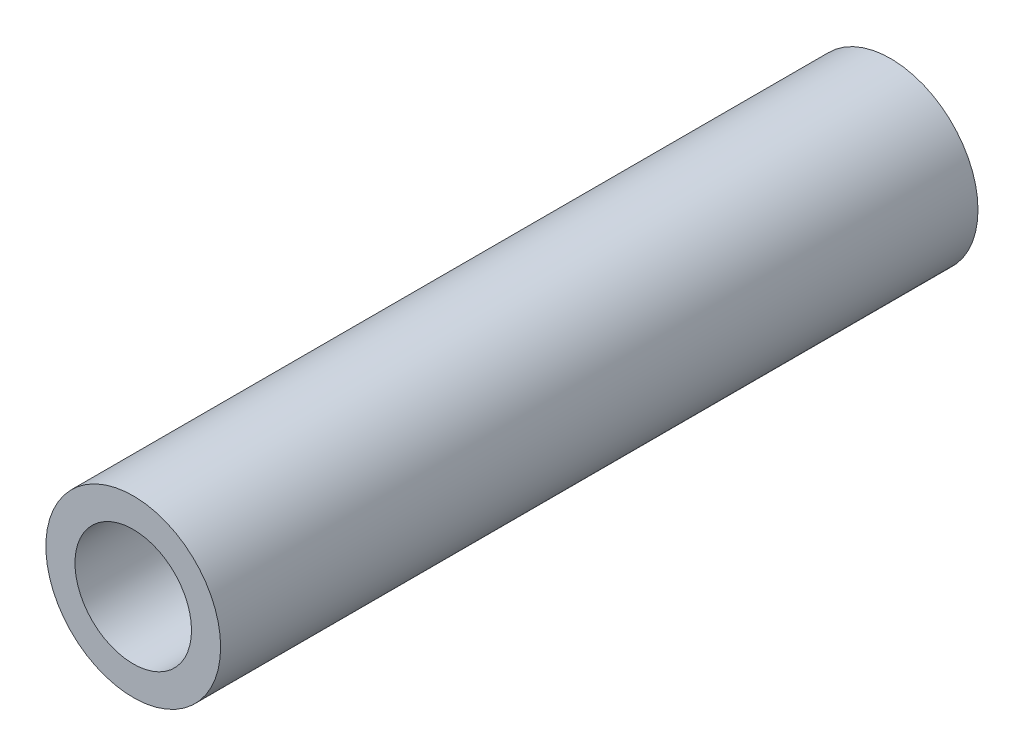
ISO-10303-21;
HEADER;
FILE_DESCRIPTION(('STEP AP214'),'2;1');
FILE_NAME('part.step','',(''),(''),'','','');
FILE_SCHEMA(('AUTOMOTIVE_DESIGN { 1 0 10303 214 1 1 1 1 }'));
ENDSEC;
DATA;
#1=APPLICATION_CONTEXT('core data for automotive mechanical design processes');
#2=APPLICATION_PROTOCOL_DEFINITION('international standard','automotive_design',2000,#1);
#3=PRODUCT_CONTEXT('',#1,'mechanical');
#4=PRODUCT('Part','Part','',(#3));
#5=PRODUCT_RELATED_PRODUCT_CATEGORY('part','',(#4));
#6=PRODUCT_DEFINITION_FORMATION('','',#4);
#7=PRODUCT_DEFINITION_CONTEXT('part definition',#1,'design');
#8=PRODUCT_DEFINITION('design','',#6,#7);
#9=PRODUCT_DEFINITION_SHAPE('','',#8);
#10=(LENGTH_UNIT() NAMED_UNIT(*) SI_UNIT(.MILLI.,.METRE.));
#11=(NAMED_UNIT(*) PLANE_ANGLE_UNIT() SI_UNIT($,.RADIAN.));
#12=(NAMED_UNIT(*) SI_UNIT($,.STERADIAN.) SOLID_ANGLE_UNIT());
#13=UNCERTAINTY_MEASURE_WITH_UNIT(LENGTH_MEASURE(1.E-05),#10,'distance_accuracy_value','');
#14=(GEOMETRIC_REPRESENTATION_CONTEXT(3) GLOBAL_UNCERTAINTY_ASSIGNED_CONTEXT((#13)) GLOBAL_UNIT_ASSIGNED_CONTEXT((#10,
#11,#12)) REPRESENTATION_CONTEXT('',''));
#15=CARTESIAN_POINT('',(0.,0.,0.));
#16=DIRECTION('',(0.,0.,1.));
#17=DIRECTION('',(1.,0.,0.));
#18=AXIS2_PLACEMENT_3D('',#15,#16,#17);
#19=CARTESIAN_POINT('',(0.,0.,13.));
#20=DIRECTION('',(0.,0.,1.));
#21=DIRECTION('',(1.,0.,0.));
#22=AXIS2_PLACEMENT_3D('',#19,#20,#21);
#23=PLANE('',#22);
#24=CARTESIAN_POINT('',(0.,0.,13.));
#25=DIRECTION('',(0.,0.,1.));
#26=DIRECTION('',(1.,0.,0.));
#27=AXIS2_PLACEMENT_3D('',#24,#25,#26);
#28=CIRCLE('',#27,1.5);
#29=CARTESIAN_POINT('',(1.5,0.,13.));
#30=VERTEX_POINT('',#29);
#31=EDGE_CURVE('E10',#30,#30,#28,.T.);
#32=ORIENTED_EDGE('',*,*,#31,.T.);
#33=EDGE_LOOP('',(#32));
#34=FACE_BOUND('',#33,.T.);
#35=CARTESIAN_POINT('',(0.,0.,13.));
#36=DIRECTION('',(0.,0.,1.));
#37=DIRECTION('',(1.,0.,0.));
#38=AXIS2_PLACEMENT_3D('',#35,#36,#37);
#39=CIRCLE('',#38,1.);
#40=CARTESIAN_POINT('',(1.,0.,13.));
#41=VERTEX_POINT('',#40);
#42=EDGE_CURVE('E43',#41,#41,#39,.T.);
#43=ORIENTED_EDGE('',*,*,#42,.F.);
#44=EDGE_LOOP('',(#43));
#45=FACE_BOUND('',#44,.T.);
#46=ADVANCED_FACE('F32',(#34,#45),#23,.T.);
#47=CARTESIAN_POINT('',(0.,0.,0.));
#48=DIRECTION('',(0.,0.,1.));
#49=DIRECTION('',(1.,0.,0.));
#50=AXIS2_PLACEMENT_3D('',#47,#48,#49);
#51=PLANE('',#50);
#52=CARTESIAN_POINT('',(0.,0.,0.));
#53=DIRECTION('',(0.,0.,1.));
#54=DIRECTION('',(1.,0.,0.));
#55=AXIS2_PLACEMENT_3D('',#52,#53,#54);
#56=CIRCLE('',#55,1.5);
#57=CARTESIAN_POINT('',(1.5,0.,0.));
#58=VERTEX_POINT('',#57);
#59=EDGE_CURVE('E36',#58,#58,#56,.T.);
#60=ORIENTED_EDGE('',*,*,#59,.F.);
#61=EDGE_LOOP('',(#60));
#62=FACE_BOUND('',#61,.T.);
#63=CARTESIAN_POINT('',(0.,0.,0.));
#64=DIRECTION('',(0.,0.,1.));
#65=DIRECTION('',(1.,0.,0.));
#66=AXIS2_PLACEMENT_3D('',#63,#64,#65);
#67=CIRCLE('',#66,1.);
#68=CARTESIAN_POINT('',(1.,0.,0.));
#69=VERTEX_POINT('',#68);
#70=EDGE_CURVE('E45',#69,#69,#67,.T.);
#71=ORIENTED_EDGE('',*,*,#70,.T.);
#72=EDGE_LOOP('',(#71));
#73=FACE_BOUND('',#72,.T.);
#74=ADVANCED_FACE('F55',(#62,#73),#51,.F.);
#75=CARTESIAN_POINT('',(0.,0.,13.));
#76=DIRECTION('',(0.,0.,-1.));
#77=DIRECTION('',(-1.,0.,0.));
#78=AXIS2_PLACEMENT_3D('',#75,#76,#77);
#79=CYLINDRICAL_SURFACE('',#78,1.5);
#80=ORIENTED_EDGE('',*,*,#31,.F.);
#81=EDGE_LOOP('',(#80));
#82=FACE_BOUND('',#81,.T.);
#83=ORIENTED_EDGE('',*,*,#59,.T.);
#84=EDGE_LOOP('',(#83));
#85=FACE_BOUND('',#84,.T.);
#86=ADVANCED_FACE('F34',(#82,#85),#79,.T.);
#87=CARTESIAN_POINT('',(0.,0.,13.));
#88=DIRECTION('',(0.,0.,-1.));
#89=DIRECTION('',(-1.,0.,0.));
#90=AXIS2_PLACEMENT_3D('',#87,#88,#89);
#91=CYLINDRICAL_SURFACE('',#90,1.);
#92=ORIENTED_EDGE('',*,*,#42,.T.);
#93=EDGE_LOOP('',(#92));
#94=FACE_BOUND('',#93,.T.);
#95=ORIENTED_EDGE('',*,*,#70,.F.);
#96=EDGE_LOOP('',(#95));
#97=FACE_BOUND('',#96,.T.);
#98=ADVANCED_FACE('F51',(#94,#97),#91,.F.);
#99=CLOSED_SHELL('',(#46,#74,#86,#98));
#100=MANIFOLD_SOLID_BREP('B2',#99);
#101=ADVANCED_BREP_SHAPE_REPRESENTATION('',(#18,#100),#14);
#102=SHAPE_DEFINITION_REPRESENTATION(#9,#101);
ENDSEC;
END-ISO-10303-21;
